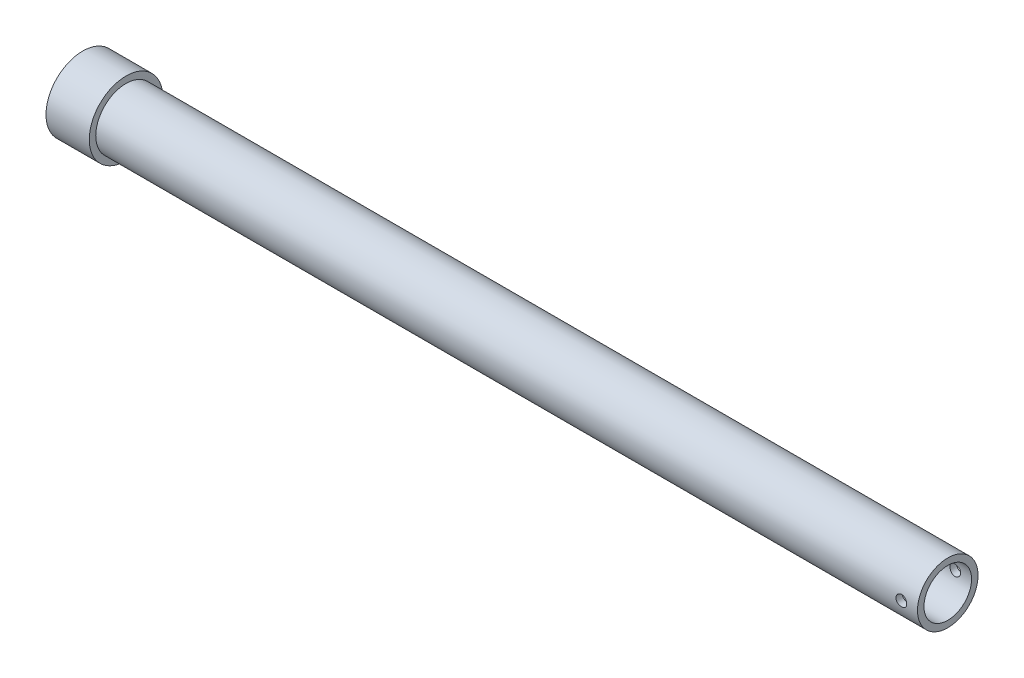
ISO-10303-21;
HEADER;
FILE_DESCRIPTION(('STEP AP214'),'2;1');
FILE_NAME('part.step','',(''),(''),'','','');
FILE_SCHEMA(('AUTOMOTIVE_DESIGN { 1 0 10303 214 1 1 1 1 }'));
ENDSEC;
DATA;
#1=APPLICATION_CONTEXT('core data for automotive mechanical design processes');
#2=APPLICATION_PROTOCOL_DEFINITION('international standard','automotive_design',2000,#1);
#3=PRODUCT_CONTEXT('',#1,'mechanical');
#4=PRODUCT('Part','Part','',(#3));
#5=PRODUCT_RELATED_PRODUCT_CATEGORY('part','',(#4));
#6=PRODUCT_DEFINITION_FORMATION('','',#4);
#7=PRODUCT_DEFINITION_CONTEXT('part definition',#1,'design');
#8=PRODUCT_DEFINITION('design','',#6,#7);
#9=PRODUCT_DEFINITION_SHAPE('','',#8);
#10=(LENGTH_UNIT() NAMED_UNIT(*) SI_UNIT(.MILLI.,.METRE.));
#11=(NAMED_UNIT(*) PLANE_ANGLE_UNIT() SI_UNIT($,.RADIAN.));
#12=(NAMED_UNIT(*) SI_UNIT($,.STERADIAN.) SOLID_ANGLE_UNIT());
#13=UNCERTAINTY_MEASURE_WITH_UNIT(LENGTH_MEASURE(1.E-05),#10,'distance_accuracy_value','');
#14=(GEOMETRIC_REPRESENTATION_CONTEXT(3) GLOBAL_UNCERTAINTY_ASSIGNED_CONTEXT((#13)) GLOBAL_UNIT_ASSIGNED_CONTEXT((#10,
#11,#12)) REPRESENTATION_CONTEXT('',''));
#15=CARTESIAN_POINT('',(0.,0.,0.));
#16=DIRECTION('',(0.,0.,1.));
#17=DIRECTION('',(1.,0.,0.));
#18=AXIS2_PLACEMENT_3D('',#15,#16,#17);
#19=CARTESIAN_POINT('',(0.,0.,0.));
#20=DIRECTION('',(-1.,0.,0.));
#21=DIRECTION('',(0.,0.,1.));
#22=AXIS2_PLACEMENT_3D('',#19,#20,#21);
#23=PLANE('',#22);
#24=CARTESIAN_POINT('',(0.,0.,0.));
#25=DIRECTION('',(-1.,0.,0.));
#26=DIRECTION('',(0.,0.,1.));
#27=AXIS2_PLACEMENT_3D('',#24,#25,#26);
#28=CIRCLE('',#27,17.);
#29=CARTESIAN_POINT('',(0.,0.,17.));
#30=VERTEX_POINT('',#29);
#31=EDGE_CURVE('E10',#30,#30,#28,.T.);
#32=ORIENTED_EDGE('',*,*,#31,.T.);
#33=EDGE_LOOP('',(#32));
#34=FACE_BOUND('',#33,.T.);
#35=ADVANCED_FACE('F34',(#34),#23,.T.);
#36=CARTESIAN_POINT('',(0.,0.,0.));
#37=DIRECTION('',(-1.,0.,0.));
#38=DIRECTION('',(0.,0.,1.));
#39=AXIS2_PLACEMENT_3D('',#36,#37,#38);
#40=CYLINDRICAL_SURFACE('',#39,17.);
#41=CARTESIAN_POINT('',(20.,0.,0.));
#42=DIRECTION('',(-1.,0.,0.));
#43=DIRECTION('',(0.,0.,1.));
#44=AXIS2_PLACEMENT_3D('',#41,#42,#43);
#45=CIRCLE('',#44,17.);
#46=CARTESIAN_POINT('',(20.,0.,17.));
#47=VERTEX_POINT('',#46);
#48=EDGE_CURVE('E46',#47,#47,#45,.T.);
#49=ORIENTED_EDGE('',*,*,#48,.T.);
#50=EDGE_LOOP('',(#49));
#51=FACE_BOUND('',#50,.T.);
#52=ORIENTED_EDGE('',*,*,#31,.F.);
#53=EDGE_LOOP('',(#52));
#54=FACE_BOUND('',#53,.T.);
#55=ADVANCED_FACE('F94',(#51,#54),#40,.T.);
#56=CARTESIAN_POINT('',(20.,-14.,0.));
#57=DIRECTION('',(1.,0.,0.));
#58=DIRECTION('',(0.,0.,-1.));
#59=AXIS2_PLACEMENT_3D('',#56,#57,#58);
#60=PLANE('',#59);
#61=CARTESIAN_POINT('',(20.,0.,0.));
#62=DIRECTION('',(-1.,0.,0.));
#63=DIRECTION('',(0.,0.,1.));
#64=AXIS2_PLACEMENT_3D('',#61,#62,#63);
#65=CIRCLE('',#64,14.);
#66=CARTESIAN_POINT('',(20.,0.,14.));
#67=VERTEX_POINT('',#66);
#68=EDGE_CURVE('E51',#67,#67,#65,.T.);
#69=ORIENTED_EDGE('',*,*,#68,.T.);
#70=EDGE_LOOP('',(#69));
#71=FACE_BOUND('',#70,.T.);
#72=ORIENTED_EDGE('',*,*,#48,.F.);
#73=EDGE_LOOP('',(#72));
#74=FACE_BOUND('',#73,.T.);
#75=ADVANCED_FACE('F90',(#71,#74),#60,.T.);
#76=CARTESIAN_POINT('',(0.,0.,0.));
#77=DIRECTION('',(-1.,0.,0.));
#78=DIRECTION('',(0.,0.,1.));
#79=AXIS2_PLACEMENT_3D('',#76,#77,#78);
#80=CYLINDRICAL_SURFACE('',#79,14.);
#81=CARTESIAN_POINT('',(395.,0.,14.));
#82=CARTESIAN_POINT('',(394.999994557398,0.139239584884697,13.9999975279519));
#83=CARTESIAN_POINT('',(394.98832809755,0.278551398798774,13.9979012185717));
#84=CARTESIAN_POINT('',(394.941995833618,0.553257461551458,13.9897405917584));
#85=CARTESIAN_POINT('',(394.907309849162,0.688648164109875,13.9836727927304));
#86=CARTESIAN_POINT('',(394.816027766762,0.951498716003346,13.9682487550673));
#87=CARTESIAN_POINT('',(394.759450635632,1.07896532023462,13.9588953637627));
#88=CARTESIAN_POINT('',(394.626044311783,1.32258294398844,13.9379246329878));
#89=CARTESIAN_POINT('',(394.549217055801,1.43873504418375,13.9263075100501));
#90=CARTESIAN_POINT('',(394.376600786983,1.65770744324837,13.9019523246795));
#91=CARTESIAN_POINT('',(394.280633870129,1.76038642030701,13.8892044205267));
#92=CARTESIAN_POINT('',(394.072845250463,1.94827611327339,13.8640984861177));
#93=CARTESIAN_POINT('',(393.961022472631,2.03348564380399,13.851740482366));
#94=CARTESIAN_POINT('',(393.723709882887,2.18459604528549,13.828718102426));
#95=CARTESIAN_POINT('',(393.598128313076,2.25035491937041,13.8180664295287));
#96=CARTESIAN_POINT('',(393.337478841335,2.35978878168927,13.799800524336));
#97=CARTESIAN_POINT('',(393.202411679276,2.40346549014526,13.7921860554493));
#98=CARTESIAN_POINT('',(392.928131178585,2.46704527057168,13.7809553111512));
#99=CARTESIAN_POINT('',(392.788976444858,2.48719373563913,13.7772977959189));
#100=CARTESIAN_POINT('',(392.509217077993,2.50390640595677,13.7742705702387));
#101=CARTESIAN_POINT('',(392.368612563608,2.50047252779552,13.7749005113397));
#102=CARTESIAN_POINT('',(392.091711102563,2.47031736473551,13.78033942777));
#103=CARTESIAN_POINT('',(391.955382809746,2.44387361595036,13.7850985960022));
#104=CARTESIAN_POINT('',(391.689129363501,2.36888575386111,13.7981816164894));
#105=CARTESIAN_POINT('',(391.559204459315,2.3203407810603,13.8065056073765));
#106=CARTESIAN_POINT('',(391.308625521131,2.20225267796381,13.8258332062344));
#107=CARTESIAN_POINT('',(391.188026118391,2.13259607876044,13.836851230427));
#108=CARTESIAN_POINT('',(390.960122497785,1.97434240206305,13.8603157063341));
#109=CARTESIAN_POINT('',(390.852819508901,1.88574357580473,13.8727622898853));
#110=CARTESIAN_POINT('',(390.652949782213,1.6906170890659,13.8978993100277));
#111=CARTESIAN_POINT('',(390.56061508202,1.58385171151664,13.9105906924877));
#112=CARTESIAN_POINT('',(390.395133867092,1.35622200140279,13.934623736005));
#113=CARTESIAN_POINT('',(390.32198751235,1.23535755129118,13.9459653858077));
#114=CARTESIAN_POINT('',(390.196930976304,0.982729125410303,13.9660408385903));
#115=CARTESIAN_POINT('',(390.145043317702,0.850953766692508,13.9747718731006));
#116=CARTESIAN_POINT('',(390.064203117808,0.580367401035953,13.9886206199705));
#117=CARTESIAN_POINT('',(390.035248369927,0.441557072364848,13.9937386799627));
#118=CARTESIAN_POINT('',(390.001415153955,0.162838985381749,13.999737506353));
#119=CARTESIAN_POINT('',(389.996218491452,0.0229710170574639,14.0006742692249));
#120=CARTESIAN_POINT('',(390.009197739763,-0.255635962260996,13.9983590537919));
#121=CARTESIAN_POINT('',(390.027372613028,-0.39437502309644,13.9951072614327));
#122=CARTESIAN_POINT('',(390.08631439849,-0.665788309880019,13.9848150834562));
#123=CARTESIAN_POINT('',(390.126921839218,-0.798498270193153,13.9778014506051));
#124=CARTESIAN_POINT('',(390.229404630185,-1.05522666669469,13.960768732277));
#125=CARTESIAN_POINT('',(390.291281317169,-1.1792445560083,13.9507494579045));
#126=CARTESIAN_POINT('',(390.435261222912,-1.41643709951419,13.9286773386827));
#127=CARTESIAN_POINT('',(390.51756079154,-1.52949072853054,13.9166051337771));
#128=CARTESIAN_POINT('',(390.699782651061,-1.74029662989024,13.8918196803142));
#129=CARTESIAN_POINT('',(390.799706424593,-1.83804761359039,13.8791063778887));
#130=CARTESIAN_POINT('',(391.015774969248,-2.01666949257317,13.8542878912599));
#131=CARTESIAN_POINT('',(391.132099700867,-2.09732417121669,13.8421918152179));
#132=CARTESIAN_POINT('',(391.376833689449,-2.23794827077401,13.8201546664427));
#133=CARTESIAN_POINT('',(391.505242524403,-2.29791841370416,13.8102135184939));
#134=CARTESIAN_POINT('',(391.769926174841,-2.39515706197431,13.7936819036384));
#135=CARTESIAN_POINT('',(391.906162210818,-2.43252842924638,13.7870762776016));
#136=CARTESIAN_POINT('',(392.183107295146,-2.48382895891454,13.7779274424092));
#137=CARTESIAN_POINT('',(392.323815889245,-2.49776049425866,13.7753838220348));
#138=CARTESIAN_POINT('',(392.603549208901,-2.50171229780528,13.7746664843415));
#139=CARTESIAN_POINT('',(392.742569077142,-2.49207328035336,13.7764304992774));
#140=CARTESIAN_POINT('',(393.016973818018,-2.44989946243101,13.7839923104721));
#141=CARTESIAN_POINT('',(393.152358707742,-2.41736476961373,13.7897900877646));
#142=CARTESIAN_POINT('',(393.415489876033,-2.33046113865353,13.8047410588042));
#143=CARTESIAN_POINT('',(393.543247551786,-2.27612576514719,13.8138890925692));
#144=CARTESIAN_POINT('',(393.787888439437,-2.14719934056739,13.8345140264404));
#145=CARTESIAN_POINT('',(393.904770982378,-2.07260704454507,13.8459910696717));
#146=CARTESIAN_POINT('',(394.12605704739,-1.90408567428783,13.8701759776461));
#147=CARTESIAN_POINT('',(394.230269231743,-1.80990741155503,13.8828984590281));
#148=CARTESIAN_POINT('',(394.421525805966,-1.60540999726032,13.9080282435319));
#149=CARTESIAN_POINT('',(394.508566241477,-1.49508713803928,13.920435473485));
#150=CARTESIAN_POINT('',(394.663657767789,-1.26037074660266,13.9436534678806));
#151=CARTESIAN_POINT('',(394.731550259392,-1.13587103767061,13.9544505684285));
#152=CARTESIAN_POINT('',(394.845349203293,-0.877084840190508,13.9730987112511));
#153=CARTESIAN_POINT('',(394.891276861498,-0.742807935956565,13.9809525934581));
#154=CARTESIAN_POINT('',(394.950230613396,-0.506731755491765,13.9911779735748));
#155=CARTESIAN_POINT('',(394.968863136937,-0.406334867671686,13.9944679971863));
#156=CARTESIAN_POINT('',(394.993749690404,-0.203971552038949,13.9988798925243));
#157=CARTESIAN_POINT('',(395.000003987182,-0.102005158109666,14.0000018109911));
#158=CARTESIAN_POINT('',(395.,0.,14.));
#159=B_SPLINE_CURVE_WITH_KNOTS('',3,(#81,#82,#83,#84,#85,#86,#87,#88,#89,#90,#91,#92,#93,#94,
#95,#96,#97,#98,#99,#100,#101,#102,#103,#104,#105,#106,#107,#108,#109,#110,#111,#112,#113,#114,
#115,#116,#117,#118,#119,#120,#121,#122,#123,#124,#125,#126,#127,#128,#129,#130,#131,#132,#133,
#134,#135,#136,#137,#138,#139,#140,#141,#142,#143,#144,#145,#146,#147,#148,#149,#150,#151,#152,
#153,#154,#155,#156,#157,#158),.UNSPECIFIED.,.T.,.F.,(4,2,2,2,2,2,2,2,2,2,2,2,2,2,2,2,2,2,2,2,2,
2,2,2,2,2,2,2,2,2,2,2,2,2,2,2,2,2,4),(0.,0.417345796741643,0.83505794937402,1.25240899749004,
1.66972014433903,2.09110796789028,2.51252437496279,2.93694536469339,3.36133328652203,
3.78125426758822,4.20114112116261,4.61603258426609,5.0309401835036,5.44811857395104,
5.86533549534555,6.28850377891477,6.71167559078147,7.13529458336172,7.55887281066886,
7.97676106621618,8.39463077078326,8.80956740145247,9.22453011509516,9.64364840488133,
10.062801969859,10.486976207779,10.9111356379344,11.3333496148674,11.7555208460959,
12.1716257235316,12.5877286444974,13.0031933708605,13.4186836366132,13.8398246877354,
14.2610626074927,14.6856934454014,15.1099134925211,15.415662334047,15.7214045841283),.UNSPECIFIED.);
#160=CARTESIAN_POINT('',(395.,0.,14.));
#161=VERTEX_POINT('',#160);
#162=EDGE_CURVE('E80',#161,#161,#159,.T.);
#163=ORIENTED_EDGE('',*,*,#162,.F.);
#164=EDGE_LOOP('',(#163));
#165=FACE_BOUND('',#164,.T.);
#166=CARTESIAN_POINT('',(395.,0.,-14.));
#167=CARTESIAN_POINT('',(394.999994557398,-0.139239584884697,-13.9999975279519));
#168=CARTESIAN_POINT('',(394.98832809755,-0.278551398798774,-13.9979012185717));
#169=CARTESIAN_POINT('',(394.941995833618,-0.553257461551458,-13.9897405917584));
#170=CARTESIAN_POINT('',(394.907309849162,-0.688648164109875,-13.9836727927304));
#171=CARTESIAN_POINT('',(394.816027766762,-0.951498716003346,-13.9682487550673));
#172=CARTESIAN_POINT('',(394.759450635632,-1.07896532023462,-13.9588953637627));
#173=CARTESIAN_POINT('',(394.626044311783,-1.32258294398844,-13.9379246329878));
#174=CARTESIAN_POINT('',(394.549217055801,-1.43873504418375,-13.9263075100501));
#175=CARTESIAN_POINT('',(394.376600786983,-1.65770744324837,-13.9019523246795));
#176=CARTESIAN_POINT('',(394.280633870129,-1.76038642030701,-13.8892044205267));
#177=CARTESIAN_POINT('',(394.072845250463,-1.94827611327339,-13.8640984861177));
#178=CARTESIAN_POINT('',(393.961022472631,-2.03348564380399,-13.851740482366));
#179=CARTESIAN_POINT('',(393.723709882887,-2.18459604528549,-13.828718102426));
#180=CARTESIAN_POINT('',(393.598128313076,-2.25035491937041,-13.8180664295287));
#181=CARTESIAN_POINT('',(393.337478841335,-2.35978878168927,-13.799800524336));
#182=CARTESIAN_POINT('',(393.202411679276,-2.40346549014526,-13.7921860554493));
#183=CARTESIAN_POINT('',(392.928131178585,-2.46704527057168,-13.7809553111512));
#184=CARTESIAN_POINT('',(392.788976444858,-2.48719373563913,-13.7772977959189));
#185=CARTESIAN_POINT('',(392.509217077993,-2.50390640595677,-13.7742705702387));
#186=CARTESIAN_POINT('',(392.368612563608,-2.50047252779552,-13.7749005113397));
#187=CARTESIAN_POINT('',(392.091711102563,-2.47031736473551,-13.78033942777));
#188=CARTESIAN_POINT('',(391.955382809746,-2.44387361595036,-13.7850985960022));
#189=CARTESIAN_POINT('',(391.689129363501,-2.36888575386111,-13.7981816164894));
#190=CARTESIAN_POINT('',(391.559204459315,-2.3203407810603,-13.8065056073765));
#191=CARTESIAN_POINT('',(391.308625521131,-2.20225267796381,-13.8258332062344));
#192=CARTESIAN_POINT('',(391.188026118391,-2.13259607876044,-13.836851230427));
#193=CARTESIAN_POINT('',(390.960122497785,-1.97434240206305,-13.8603157063341));
#194=CARTESIAN_POINT('',(390.852819508901,-1.88574357580473,-13.8727622898853));
#195=CARTESIAN_POINT('',(390.652949782213,-1.6906170890659,-13.8978993100277));
#196=CARTESIAN_POINT('',(390.56061508202,-1.58385171151664,-13.9105906924877));
#197=CARTESIAN_POINT('',(390.395133867092,-1.35622200140279,-13.934623736005));
#198=CARTESIAN_POINT('',(390.32198751235,-1.23535755129118,-13.9459653858077));
#199=CARTESIAN_POINT('',(390.196930976304,-0.982729125410303,-13.9660408385903));
#200=CARTESIAN_POINT('',(390.145043317702,-0.850953766692508,-13.9747718731006));
#201=CARTESIAN_POINT('',(390.064203117808,-0.580367401035953,-13.9886206199705));
#202=CARTESIAN_POINT('',(390.035248369927,-0.441557072364848,-13.9937386799627));
#203=CARTESIAN_POINT('',(390.001415153955,-0.162838985381749,-13.999737506353));
#204=CARTESIAN_POINT('',(389.996218491452,-0.0229710170574639,-14.0006742692249));
#205=CARTESIAN_POINT('',(390.009197739763,0.255635962260996,-13.9983590537919));
#206=CARTESIAN_POINT('',(390.027372613028,0.39437502309644,-13.9951072614327));
#207=CARTESIAN_POINT('',(390.08631439849,0.665788309880019,-13.9848150834562));
#208=CARTESIAN_POINT('',(390.126921839218,0.798498270193153,-13.9778014506051));
#209=CARTESIAN_POINT('',(390.229404630185,1.05522666669469,-13.960768732277));
#210=CARTESIAN_POINT('',(390.291281317169,1.1792445560083,-13.9507494579045));
#211=CARTESIAN_POINT('',(390.435261222912,1.41643709951419,-13.9286773386827));
#212=CARTESIAN_POINT('',(390.51756079154,1.52949072853054,-13.9166051337771));
#213=CARTESIAN_POINT('',(390.699782651061,1.74029662989024,-13.8918196803142));
#214=CARTESIAN_POINT('',(390.799706424593,1.83804761359039,-13.8791063778887));
#215=CARTESIAN_POINT('',(391.015774969248,2.01666949257317,-13.8542878912599));
#216=CARTESIAN_POINT('',(391.132099700867,2.09732417121669,-13.8421918152179));
#217=CARTESIAN_POINT('',(391.376833689449,2.23794827077401,-13.8201546664427));
#218=CARTESIAN_POINT('',(391.505242524403,2.29791841370416,-13.8102135184939));
#219=CARTESIAN_POINT('',(391.769926174841,2.39515706197431,-13.7936819036384));
#220=CARTESIAN_POINT('',(391.906162210818,2.43252842924638,-13.7870762776016));
#221=CARTESIAN_POINT('',(392.183107295146,2.48382895891454,-13.7779274424092));
#222=CARTESIAN_POINT('',(392.323815889245,2.49776049425866,-13.7753838220348));
#223=CARTESIAN_POINT('',(392.603549208901,2.50171229780528,-13.7746664843415));
#224=CARTESIAN_POINT('',(392.742569077142,2.49207328035336,-13.7764304992774));
#225=CARTESIAN_POINT('',(393.016973818018,2.44989946243101,-13.7839923104721));
#226=CARTESIAN_POINT('',(393.152358707742,2.41736476961373,-13.7897900877646));
#227=CARTESIAN_POINT('',(393.415489876033,2.33046113865353,-13.8047410588042));
#228=CARTESIAN_POINT('',(393.543247551786,2.27612576514719,-13.8138890925692));
#229=CARTESIAN_POINT('',(393.787888439437,2.14719934056739,-13.8345140264404));
#230=CARTESIAN_POINT('',(393.904770982378,2.07260704454507,-13.8459910696717));
#231=CARTESIAN_POINT('',(394.12605704739,1.90408567428783,-13.8701759776461));
#232=CARTESIAN_POINT('',(394.230269231743,1.80990741155503,-13.8828984590281));
#233=CARTESIAN_POINT('',(394.421525805966,1.60540999726032,-13.9080282435319));
#234=CARTESIAN_POINT('',(394.508566241477,1.49508713803928,-13.920435473485));
#235=CARTESIAN_POINT('',(394.663657767789,1.26037074660266,-13.9436534678806));
#236=CARTESIAN_POINT('',(394.731550259392,1.13587103767061,-13.9544505684285));
#237=CARTESIAN_POINT('',(394.845349203293,0.877084840190508,-13.9730987112511));
#238=CARTESIAN_POINT('',(394.891276861498,0.742807935956565,-13.9809525934581));
#239=CARTESIAN_POINT('',(394.950230613396,0.506731755491765,-13.9911779735748));
#240=CARTESIAN_POINT('',(394.968863136937,0.406334867671686,-13.9944679971863));
#241=CARTESIAN_POINT('',(394.993749690404,0.203971552038949,-13.9988798925243));
#242=CARTESIAN_POINT('',(395.000003987182,0.102005158109666,-14.0000018109911));
#243=CARTESIAN_POINT('',(395.,0.,-14.));
#244=B_SPLINE_CURVE_WITH_KNOTS('',3,(#166,#167,#168,#169,#170,#171,#172,#173,#174,#175,#176,
#177,#178,#179,#180,#181,#182,#183,#184,#185,#186,#187,#188,#189,#190,#191,#192,#193,#194,#195,
#196,#197,#198,#199,#200,#201,#202,#203,#204,#205,#206,#207,#208,#209,#210,#211,#212,#213,#214,
#215,#216,#217,#218,#219,#220,#221,#222,#223,#224,#225,#226,#227,#228,#229,#230,#231,#232,#233,
#234,#235,#236,#237,#238,#239,#240,#241,#242,#243),.UNSPECIFIED.,.T.,.F.,(4,2,2,2,2,2,2,2,2,2,2,
2,2,2,2,2,2,2,2,2,2,2,2,2,2,2,2,2,2,2,2,2,2,2,2,2,2,2,4),(0.,0.417345796741643,0.83505794937402,
1.25240899749004,1.66972014433903,2.09110796789028,2.51252437496279,2.93694536469339,
3.36133328652203,3.78125426758822,4.20114112116261,4.61603258426609,5.0309401835036,
5.44811857395104,5.86533549534555,6.28850377891477,6.71167559078147,7.13529458336172,
7.55887281066886,7.97676106621618,8.39463077078326,8.80956740145247,9.22453011509516,
9.64364840488133,10.062801969859,10.486976207779,10.9111356379344,11.3333496148674,
11.7555208460959,12.1716257235316,12.5877286444974,13.0031933708605,13.4186836366132,
13.8398246877354,14.2610626074927,14.6856934454014,15.1099134925211,15.415662334047,
15.7214045841283),.UNSPECIFIED.);
#245=CARTESIAN_POINT('',(395.,0.,-14.));
#246=VERTEX_POINT('',#245);
#247=EDGE_CURVE('E74',#246,#246,#244,.T.);
#248=ORIENTED_EDGE('',*,*,#247,.F.);
#249=EDGE_LOOP('',(#248));
#250=FACE_BOUND('',#249,.T.);
#251=CARTESIAN_POINT('',(400.,0.,0.));
#252=DIRECTION('',(-1.,0.,0.));
#253=DIRECTION('',(0.,0.,1.));
#254=AXIS2_PLACEMENT_3D('',#251,#252,#253);
#255=CIRCLE('',#254,14.);
#256=CARTESIAN_POINT('',(400.,0.,14.));
#257=VERTEX_POINT('',#256);
#258=EDGE_CURVE('E197',#257,#257,#255,.T.);
#259=ORIENTED_EDGE('',*,*,#258,.T.);
#260=EDGE_LOOP('',(#259));
#261=FACE_BOUND('',#260,.T.);
#262=ORIENTED_EDGE('',*,*,#68,.F.);
#263=EDGE_LOOP('',(#262));
#264=FACE_BOUND('',#263,.T.);
#265=ADVANCED_FACE('F85',(#165,#250,#261,#264),#80,.T.);
#266=CARTESIAN_POINT('',(400.,-11.,0.));
#267=DIRECTION('',(1.,0.,0.));
#268=DIRECTION('',(0.,0.,-1.));
#269=AXIS2_PLACEMENT_3D('',#266,#267,#268);
#270=PLANE('',#269);
#271=CARTESIAN_POINT('',(400.,0.,0.));
#272=DIRECTION('',(-1.,0.,0.));
#273=DIRECTION('',(0.,0.,1.));
#274=AXIS2_PLACEMENT_3D('',#271,#272,#273);
#275=CIRCLE('',#274,11.);
#276=CARTESIAN_POINT('',(400.,0.,11.));
#277=VERTEX_POINT('',#276);
#278=EDGE_CURVE('E196',#277,#277,#275,.T.);
#279=ORIENTED_EDGE('',*,*,#278,.T.);
#280=EDGE_LOOP('',(#279));
#281=FACE_BOUND('',#280,.T.);
#282=ORIENTED_EDGE('',*,*,#258,.F.);
#283=EDGE_LOOP('',(#282));
#284=FACE_BOUND('',#283,.T.);
#285=ADVANCED_FACE('F89',(#281,#284),#270,.T.);
#286=CARTESIAN_POINT('',(0.,0.,0.));
#287=DIRECTION('',(-1.,0.,0.));
#288=DIRECTION('',(0.,0.,1.));
#289=AXIS2_PLACEMENT_3D('',#286,#287,#288);
#290=CYLINDRICAL_SURFACE('',#289,11.);
#291=CARTESIAN_POINT('',(395.,0.,11.));
#292=CARTESIAN_POINT('',(394.999995468174,-0.138518278596906,10.9999974735185));
#293=CARTESIAN_POINT('',(394.988448772423,-0.277090172258011,10.9973570934613));
#294=CARTESIAN_POINT('',(394.942620523938,-0.550288594599326,10.987079320306));
#295=CARTESIAN_POINT('',(394.908323604045,-0.684912392220731,10.9794385496265));
#296=CARTESIAN_POINT('',(394.818131951368,-0.946227671984925,10.9600095312294));
#297=CARTESIAN_POINT('',(394.762260672019,-1.07292759495649,10.9482257885674));
#298=CARTESIAN_POINT('',(394.630582886619,-1.31515227582568,10.921778201627));
#299=CARTESIAN_POINT('',(394.554776579158,-1.43067714503183,10.9071143860399));
#300=CARTESIAN_POINT('',(394.383997955393,-1.64926760444638,10.8762265816814));
#301=CARTESIAN_POINT('',(394.288747426525,-1.75211293892049,10.8599819758326));
#302=CARTESIAN_POINT('',(394.082381025863,-1.94051389816611,10.827906511833));
#303=CARTESIAN_POINT('',(393.971263649306,-2.02606788121785,10.8120756930933));
#304=CARTESIAN_POINT('',(393.734667944716,-2.17844599401788,10.7824158369221));
#305=CARTESIAN_POINT('',(393.609033003694,-2.24503254356576,10.7686131580577));
#306=CARTESIAN_POINT('',(393.347990499418,-2.35606069717871,10.7448696147509));
#307=CARTESIAN_POINT('',(393.212584207938,-2.40050517717751,10.7349282488168));
#308=CARTESIAN_POINT('',(392.938240812883,-2.46525349412721,10.7202434469831));
#309=CARTESIAN_POINT('',(392.799400736877,-2.48594892680757,10.715415797339));
#310=CARTESIAN_POINT('',(392.520141772787,-2.50382988451489,10.7112523406768));
#311=CARTESIAN_POINT('',(392.379723097338,-2.50101853886554,10.711915802658));
#312=CARTESIAN_POINT('',(392.104227116651,-2.47228016958764,10.7185835035919));
#313=CARTESIAN_POINT('',(391.969099093805,-2.44681104599439,10.7244819412976));
#314=CARTESIAN_POINT('',(391.705085513845,-2.37420684920503,10.7407873672743));
#315=CARTESIAN_POINT('',(391.576200332373,-2.3270704740429,10.7511946264744));
#316=CARTESIAN_POINT('',(391.32705932819,-2.21205734402547,10.7754474384537));
#317=CARTESIAN_POINT('',(391.206886482236,-2.14400712086011,10.7893215597825));
#318=CARTESIAN_POINT('',(390.979497446889,-1.98921977920412,10.8189276843241));
#319=CARTESIAN_POINT('',(390.872283159736,-1.90247992237138,10.8346599596346));
#320=CARTESIAN_POINT('',(390.671221438179,-1.71036518003521,10.8666615287251));
#321=CARTESIAN_POINT('',(390.577745573484,-1.60460166742831,10.882934773515));
#322=CARTESIAN_POINT('',(390.409794111293,-1.37871229840976,10.9138502597158));
#323=CARTESIAN_POINT('',(390.335318913301,-1.25858614009084,10.9284924668293));
#324=CARTESIAN_POINT('',(390.207379612028,-1.00690799179919,10.9545497424637));
#325=CARTESIAN_POINT('',(390.153967226378,-0.875328834348185,10.9659568484873));
#326=CARTESIAN_POINT('',(390.070115994132,-0.604745122491714,10.9841998956698));
#327=CARTESIAN_POINT('',(390.039673534178,-0.465741739663735,10.9910365557784));
#328=CARTESIAN_POINT('',(390.003173762527,-0.187439840192746,10.9992650071756));
#329=CARTESIAN_POINT('',(389.996609308683,-0.0482110923370511,11.0007700184113));
#330=CARTESIAN_POINT('',(390.006673039853,0.229353886680091,10.9984842255063));
#331=CARTESIAN_POINT('',(390.023299519406,0.367690182720846,10.9946938107912));
#332=CARTESIAN_POINT('',(390.078853166905,0.637841677218453,10.9823148103742));
#333=CARTESIAN_POINT('',(390.117511546444,0.769715036814426,10.973784087055));
#334=CARTESIAN_POINT('',(390.215731027457,1.02510393087761,10.9528806132367));
#335=CARTESIAN_POINT('',(390.275294004253,1.1486187143229,10.9405075180554));
#336=CARTESIAN_POINT('',(390.414669143555,1.38586085256057,10.9130143275095));
#337=CARTESIAN_POINT('',(390.494775626773,1.49941068522721,10.8978552985532));
#338=CARTESIAN_POINT('',(390.67257932844,1.71163773579053,10.866546095646));
#339=CARTESIAN_POINT('',(390.770279026547,1.8103128535797,10.8503957821912));
#340=CARTESIAN_POINT('',(390.982830965133,1.99201706218097,10.8185287714487));
#341=CARTESIAN_POINT('',(391.097987241787,2.07469366594064,10.8028272119253));
#342=CARTESIAN_POINT('',(391.34084639067,2.21953814406555,10.7740023321604));
#343=CARTESIAN_POINT('',(391.46854870796,2.28170692501019,10.7608788979592));
#344=CARTESIAN_POINT('',(391.732180469569,2.38333597241929,10.7388274870674));
#345=CARTESIAN_POINT('',(391.868057323743,2.42292716221707,10.7298753781702));
#346=CARTESIAN_POINT('',(392.144766906699,2.47865258340367,10.7171411058581));
#347=CARTESIAN_POINT('',(392.285598765136,2.49479091341616,10.7133580391079));
#348=CARTESIAN_POINT('',(392.564658619311,2.50296739214167,10.7114502943222));
#349=CARTESIAN_POINT('',(392.702869599334,2.49556548501072,10.7131941458177));
#350=CARTESIAN_POINT('',(392.976018910188,2.45813115403284,10.7218446846914));
#351=CARTESIAN_POINT('',(393.110957286111,2.4280990421701,10.7287513008948));
#352=CARTESIAN_POINT('',(393.373243397366,2.3465369236061,10.7468826027048));
#353=CARTESIAN_POINT('',(393.500619691142,2.29509457527994,10.758089666867));
#354=CARTESIAN_POINT('',(393.745014706901,2.17224536606879,10.783564723281));
#355=CARTESIAN_POINT('',(393.862032250326,2.10083623731224,10.7978330631966));
#356=CARTESIAN_POINT('',(394.085134427655,1.93824996891053,10.828211072634));
#357=CARTESIAN_POINT('',(394.190925722207,1.84667645642838,10.8443540558786));
#358=CARTESIAN_POINT('',(394.385823185082,1.64715628932422,10.8764454859305));
#359=CARTESIAN_POINT('',(394.474925470966,1.53920583540679,10.8923938866665));
#360=CARTESIAN_POINT('',(394.635138060234,1.3081406051506,10.9225693389041));
#361=CARTESIAN_POINT('',(394.705973823333,1.18483162187623,10.9367686161711));
#362=CARTESIAN_POINT('',(394.825799970663,0.927755967711712,10.9615640551399));
#363=CARTESIAN_POINT('',(394.874807994787,0.793997844337711,10.9721631246672));
#364=CARTESIAN_POINT('',(394.941227906176,0.550163071539627,10.9867559512784));
#365=CARTESIAN_POINT('',(394.963223987689,0.441368111138492,10.9916908558499));
#366=CARTESIAN_POINT('',(394.992611473579,0.221726814930917,10.9983138080738));
#367=CARTESIAN_POINT('',(395.000003627619,0.110880584717102,11.0000020223883));
#368=CARTESIAN_POINT('',(395.,0.,11.));
#369=B_SPLINE_CURVE_WITH_KNOTS('',3,(#291,#292,#293,#294,#295,#296,#297,#298,#299,#300,#301,
#302,#303,#304,#305,#306,#307,#308,#309,#310,#311,#312,#313,#314,#315,#316,#317,#318,#319,#320,
#321,#322,#323,#324,#325,#326,#327,#328,#329,#330,#331,#332,#333,#334,#335,#336,#337,#338,#339,
#340,#341,#342,#343,#344,#345,#346,#347,#348,#349,#350,#351,#352,#353,#354,#355,#356,#357,#358,
#359,#360,#361,#362,#363,#364,#365,#366,#367,#368),.UNSPECIFIED.,.T.,.F.,(4,2,2,2,2,2,2,2,2,2,2,
2,2,2,2,2,2,2,2,2,2,2,2,2,2,2,2,2,2,2,2,2,2,2,2,2,2,2,4),(0.,0.415148849633319,
0.830578406996924,1.2455576175532,1.66053269430527,2.08192389396808,2.50335508365801,
2.92985362973414,3.35629676538242,3.77560244898095,4.19485231368764,4.60581714174245,
5.01680666753972,5.43130157438855,5.84585725297981,6.27011531803709,6.69438230269867,
7.11968464096652,7.54492006169902,7.96106941916768,8.37718817463633,8.78833576149044,
9.1995202412309,9.61696129328779,10.0344612272568,10.460313215404,10.8861463755949,
11.30948441909,11.7327484710941,12.1460204395148,12.5592867105955,12.9708773657617,
13.3825147893181,13.8031102578592,14.2238034502008,14.6504927745348,15.0768366452217,
15.4091704772437,15.7414872491402),.UNSPECIFIED.);
#370=CARTESIAN_POINT('',(395.,0.,11.));
#371=VERTEX_POINT('',#370);
#372=EDGE_CURVE('E37',#371,#371,#369,.T.);
#373=ORIENTED_EDGE('',*,*,#372,.F.);
#374=EDGE_LOOP('',(#373));
#375=FACE_BOUND('',#374,.T.);
#376=CARTESIAN_POINT('',(395.,0.,-11.));
#377=CARTESIAN_POINT('',(394.999995468174,0.138518278596906,-10.9999974735185));
#378=CARTESIAN_POINT('',(394.988448772423,0.277090172258011,-10.9973570934613));
#379=CARTESIAN_POINT('',(394.942620523938,0.550288594599326,-10.987079320306));
#380=CARTESIAN_POINT('',(394.908323604045,0.684912392220731,-10.9794385496265));
#381=CARTESIAN_POINT('',(394.818131951368,0.946227671984925,-10.9600095312294));
#382=CARTESIAN_POINT('',(394.762260672019,1.07292759495649,-10.9482257885674));
#383=CARTESIAN_POINT('',(394.630582886619,1.31515227582568,-10.921778201627));
#384=CARTESIAN_POINT('',(394.554776579158,1.43067714503183,-10.9071143860399));
#385=CARTESIAN_POINT('',(394.383997955393,1.64926760444638,-10.8762265816814));
#386=CARTESIAN_POINT('',(394.288747426525,1.75211293892049,-10.8599819758326));
#387=CARTESIAN_POINT('',(394.082381025863,1.94051389816611,-10.827906511833));
#388=CARTESIAN_POINT('',(393.971263649306,2.02606788121785,-10.8120756930933));
#389=CARTESIAN_POINT('',(393.734667944716,2.17844599401788,-10.7824158369221));
#390=CARTESIAN_POINT('',(393.609033003694,2.24503254356576,-10.7686131580577));
#391=CARTESIAN_POINT('',(393.347990499418,2.35606069717871,-10.7448696147509));
#392=CARTESIAN_POINT('',(393.212584207938,2.40050517717751,-10.7349282488168));
#393=CARTESIAN_POINT('',(392.938240812883,2.46525349412721,-10.7202434469831));
#394=CARTESIAN_POINT('',(392.799400736877,2.48594892680757,-10.715415797339));
#395=CARTESIAN_POINT('',(392.520141772787,2.50382988451489,-10.7112523406768));
#396=CARTESIAN_POINT('',(392.379723097338,2.50101853886554,-10.711915802658));
#397=CARTESIAN_POINT('',(392.104227116651,2.47228016958764,-10.7185835035919));
#398=CARTESIAN_POINT('',(391.969099093805,2.44681104599439,-10.7244819412976));
#399=CARTESIAN_POINT('',(391.705085513845,2.37420684920503,-10.7407873672743));
#400=CARTESIAN_POINT('',(391.576200332373,2.3270704740429,-10.7511946264744));
#401=CARTESIAN_POINT('',(391.32705932819,2.21205734402547,-10.7754474384537));
#402=CARTESIAN_POINT('',(391.206886482236,2.14400712086011,-10.7893215597825));
#403=CARTESIAN_POINT('',(390.979497446889,1.98921977920412,-10.8189276843241));
#404=CARTESIAN_POINT('',(390.872283159736,1.90247992237138,-10.8346599596346));
#405=CARTESIAN_POINT('',(390.671221438179,1.71036518003521,-10.8666615287251));
#406=CARTESIAN_POINT('',(390.577745573484,1.60460166742831,-10.882934773515));
#407=CARTESIAN_POINT('',(390.409794111293,1.37871229840976,-10.9138502597158));
#408=CARTESIAN_POINT('',(390.335318913301,1.25858614009084,-10.9284924668293));
#409=CARTESIAN_POINT('',(390.207379612028,1.00690799179919,-10.9545497424637));
#410=CARTESIAN_POINT('',(390.153967226378,0.875328834348185,-10.9659568484873));
#411=CARTESIAN_POINT('',(390.070115994132,0.604745122491714,-10.9841998956698));
#412=CARTESIAN_POINT('',(390.039673534178,0.465741739663735,-10.9910365557784));
#413=CARTESIAN_POINT('',(390.003173762527,0.187439840192746,-10.9992650071756));
#414=CARTESIAN_POINT('',(389.996609308683,0.0482110923370511,-11.0007700184113));
#415=CARTESIAN_POINT('',(390.006673039853,-0.229353886680091,-10.9984842255063));
#416=CARTESIAN_POINT('',(390.023299519406,-0.367690182720846,-10.9946938107912));
#417=CARTESIAN_POINT('',(390.078853166905,-0.637841677218453,-10.9823148103742));
#418=CARTESIAN_POINT('',(390.117511546444,-0.769715036814426,-10.973784087055));
#419=CARTESIAN_POINT('',(390.215731027457,-1.02510393087761,-10.9528806132367));
#420=CARTESIAN_POINT('',(390.275294004253,-1.1486187143229,-10.9405075180554));
#421=CARTESIAN_POINT('',(390.414669143555,-1.38586085256057,-10.9130143275095));
#422=CARTESIAN_POINT('',(390.494775626773,-1.49941068522721,-10.8978552985532));
#423=CARTESIAN_POINT('',(390.67257932844,-1.71163773579053,-10.866546095646));
#424=CARTESIAN_POINT('',(390.770279026547,-1.8103128535797,-10.8503957821912));
#425=CARTESIAN_POINT('',(390.982830965133,-1.99201706218097,-10.8185287714487));
#426=CARTESIAN_POINT('',(391.097987241787,-2.07469366594064,-10.8028272119253));
#427=CARTESIAN_POINT('',(391.34084639067,-2.21953814406555,-10.7740023321604));
#428=CARTESIAN_POINT('',(391.46854870796,-2.28170692501019,-10.7608788979592));
#429=CARTESIAN_POINT('',(391.732180469569,-2.38333597241929,-10.7388274870674));
#430=CARTESIAN_POINT('',(391.868057323743,-2.42292716221707,-10.7298753781702));
#431=CARTESIAN_POINT('',(392.144766906699,-2.47865258340367,-10.7171411058581));
#432=CARTESIAN_POINT('',(392.285598765136,-2.49479091341616,-10.7133580391079));
#433=CARTESIAN_POINT('',(392.564658619311,-2.50296739214167,-10.7114502943222));
#434=CARTESIAN_POINT('',(392.702869599334,-2.49556548501072,-10.7131941458177));
#435=CARTESIAN_POINT('',(392.976018910188,-2.45813115403284,-10.7218446846914));
#436=CARTESIAN_POINT('',(393.110957286111,-2.4280990421701,-10.7287513008948));
#437=CARTESIAN_POINT('',(393.373243397366,-2.3465369236061,-10.7468826027048));
#438=CARTESIAN_POINT('',(393.500619691142,-2.29509457527994,-10.758089666867));
#439=CARTESIAN_POINT('',(393.745014706901,-2.17224536606879,-10.783564723281));
#440=CARTESIAN_POINT('',(393.862032250326,-2.10083623731224,-10.7978330631966));
#441=CARTESIAN_POINT('',(394.085134427655,-1.93824996891053,-10.828211072634));
#442=CARTESIAN_POINT('',(394.190925722207,-1.84667645642838,-10.8443540558786));
#443=CARTESIAN_POINT('',(394.385823185082,-1.64715628932422,-10.8764454859305));
#444=CARTESIAN_POINT('',(394.474925470966,-1.53920583540679,-10.8923938866665));
#445=CARTESIAN_POINT('',(394.635138060234,-1.3081406051506,-10.9225693389041));
#446=CARTESIAN_POINT('',(394.705973823333,-1.18483162187623,-10.9367686161711));
#447=CARTESIAN_POINT('',(394.825799970663,-0.927755967711712,-10.9615640551399));
#448=CARTESIAN_POINT('',(394.874807994787,-0.793997844337711,-10.9721631246672));
#449=CARTESIAN_POINT('',(394.941227906176,-0.550163071539627,-10.9867559512784));
#450=CARTESIAN_POINT('',(394.963223987689,-0.441368111138492,-10.9916908558499));
#451=CARTESIAN_POINT('',(394.992611473579,-0.221726814930917,-10.9983138080738));
#452=CARTESIAN_POINT('',(395.000003627619,-0.110880584717102,-11.0000020223883));
#453=CARTESIAN_POINT('',(395.,0.,-11.));
#454=B_SPLINE_CURVE_WITH_KNOTS('',3,(#376,#377,#378,#379,#380,#381,#382,#383,#384,#385,#386,
#387,#388,#389,#390,#391,#392,#393,#394,#395,#396,#397,#398,#399,#400,#401,#402,#403,#404,#405,
#406,#407,#408,#409,#410,#411,#412,#413,#414,#415,#416,#417,#418,#419,#420,#421,#422,#423,#424,
#425,#426,#427,#428,#429,#430,#431,#432,#433,#434,#435,#436,#437,#438,#439,#440,#441,#442,#443,
#444,#445,#446,#447,#448,#449,#450,#451,#452,#453),.UNSPECIFIED.,.T.,.F.,(4,2,2,2,2,2,2,2,2,2,2,
2,2,2,2,2,2,2,2,2,2,2,2,2,2,2,2,2,2,2,2,2,2,2,2,2,2,2,4),(0.,0.415148849633319,
0.830578406996924,1.2455576175532,1.66053269430527,2.08192389396808,2.50335508365801,
2.92985362973414,3.35629676538242,3.77560244898095,4.19485231368764,4.60581714174245,
5.01680666753972,5.43130157438855,5.84585725297981,6.27011531803709,6.69438230269867,
7.11968464096652,7.54492006169902,7.96106941916768,8.37718817463633,8.78833576149044,
9.1995202412309,9.61696129328779,10.0344612272568,10.460313215404,10.8861463755949,
11.30948441909,11.7327484710941,12.1460204395148,12.5592867105955,12.9708773657617,
13.3825147893181,13.8031102578592,14.2238034502008,14.6504927745348,15.0768366452217,
15.4091704772437,15.7414872491402),.UNSPECIFIED.);
#455=CARTESIAN_POINT('',(395.,0.,-11.));
#456=VERTEX_POINT('',#455);
#457=EDGE_CURVE('E54',#456,#456,#454,.T.);
#458=ORIENTED_EDGE('',*,*,#457,.F.);
#459=EDGE_LOOP('',(#458));
#460=FACE_BOUND('',#459,.T.);
#461=CARTESIAN_POINT('',(20.,0.,0.));
#462=DIRECTION('',(-1.,0.,0.));
#463=DIRECTION('',(0.,0.,1.));
#464=AXIS2_PLACEMENT_3D('',#461,#462,#463);
#465=CIRCLE('',#464,11.);
#466=CARTESIAN_POINT('',(20.,0.,11.));
#467=VERTEX_POINT('',#466);
#468=EDGE_CURVE('E193',#467,#467,#465,.T.);
#469=ORIENTED_EDGE('',*,*,#468,.T.);
#470=EDGE_LOOP('',(#469));
#471=FACE_BOUND('',#470,.T.);
#472=ORIENTED_EDGE('',*,*,#278,.F.);
#473=EDGE_LOOP('',(#472));
#474=FACE_BOUND('',#473,.T.);
#475=ADVANCED_FACE('F59',(#375,#460,#471,#474),#290,.F.);
#476=CARTESIAN_POINT('',(20.,0.,0.));
#477=DIRECTION('',(1.,0.,0.));
#478=DIRECTION('',(0.,0.,-1.));
#479=AXIS2_PLACEMENT_3D('',#476,#477,#478);
#480=PLANE('',#479);
#481=ORIENTED_EDGE('',*,*,#468,.F.);
#482=EDGE_LOOP('',(#481));
#483=FACE_BOUND('',#482,.T.);
#484=ADVANCED_FACE('F67',(#483),#480,.T.);
#485=CARTESIAN_POINT('',(392.5,0.,-17.));
#486=DIRECTION('',(0.,0.,1.));
#487=DIRECTION('',(1.,0.,0.));
#488=AXIS2_PLACEMENT_3D('',#485,#486,#487);
#489=CYLINDRICAL_SURFACE('',#488,2.50000000000002);
#490=ORIENTED_EDGE('',*,*,#247,.T.);
#491=EDGE_LOOP('',(#490));
#492=FACE_BOUND('',#491,.T.);
#493=ORIENTED_EDGE('',*,*,#457,.T.);
#494=EDGE_LOOP('',(#493));
#495=FACE_BOUND('',#494,.T.);
#496=ADVANCED_FACE('F63',(#492,#495),#489,.F.);
#497=ORIENTED_EDGE('',*,*,#162,.T.);
#498=EDGE_LOOP('',(#497));
#499=FACE_BOUND('',#498,.T.);
#500=ORIENTED_EDGE('',*,*,#372,.T.);
#501=EDGE_LOOP('',(#500));
#502=FACE_BOUND('',#501,.T.);
#503=ADVANCED_FACE('F66',(#499,#502),#489,.F.);
#504=CLOSED_SHELL('',(#35,#55,#75,#265,#285,#475,#484,#496,#503));
#505=MANIFOLD_SOLID_BREP('B2',#504);
#506=ADVANCED_BREP_SHAPE_REPRESENTATION('',(#18,#505),#14);
#507=SHAPE_DEFINITION_REPRESENTATION(#9,#506);
ENDSEC;
END-ISO-10303-21;
